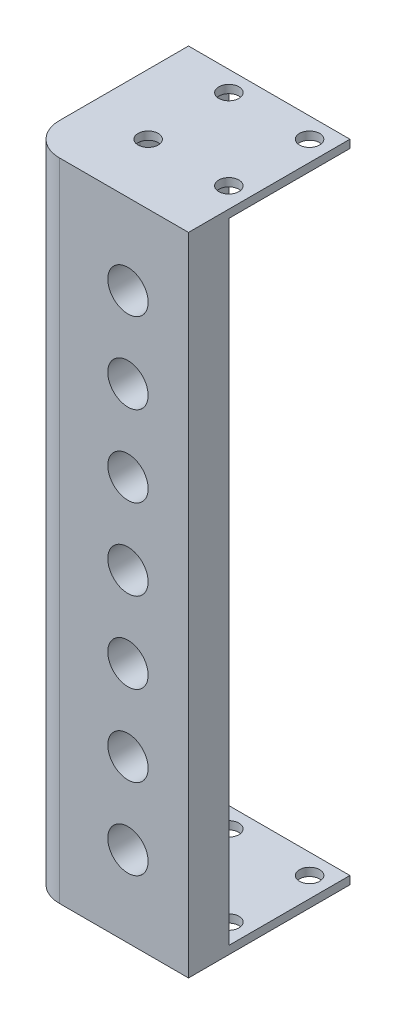
ISO-10303-21;
HEADER;
FILE_DESCRIPTION(('STEP AP214'),'2;1');
FILE_NAME('part.step','',(''),(''),'','','');
FILE_SCHEMA(('AUTOMOTIVE_DESIGN { 1 0 10303 214 1 1 1 1 }'));
ENDSEC;
DATA;
#1=APPLICATION_CONTEXT('core data for automotive mechanical design processes');
#2=APPLICATION_PROTOCOL_DEFINITION('international standard','automotive_design',2000,#1);
#3=PRODUCT_CONTEXT('',#1,'mechanical');
#4=PRODUCT('Part','Part','',(#3));
#5=PRODUCT_RELATED_PRODUCT_CATEGORY('part','',(#4));
#6=PRODUCT_DEFINITION_FORMATION('','',#4);
#7=PRODUCT_DEFINITION_CONTEXT('part definition',#1,'design');
#8=PRODUCT_DEFINITION('design','',#6,#7);
#9=PRODUCT_DEFINITION_SHAPE('','',#8);
#10=(LENGTH_UNIT() NAMED_UNIT(*) SI_UNIT(.MILLI.,.METRE.));
#11=(NAMED_UNIT(*) PLANE_ANGLE_UNIT() SI_UNIT($,.RADIAN.));
#12=(NAMED_UNIT(*) SI_UNIT($,.STERADIAN.) SOLID_ANGLE_UNIT());
#13=UNCERTAINTY_MEASURE_WITH_UNIT(LENGTH_MEASURE(1.E-05),#10,'distance_accuracy_value','');
#14=(GEOMETRIC_REPRESENTATION_CONTEXT(3) GLOBAL_UNCERTAINTY_ASSIGNED_CONTEXT((#13)) GLOBAL_UNIT_ASSIGNED_CONTEXT((#10,
#11,#12)) REPRESENTATION_CONTEXT('',''));
#15=CARTESIAN_POINT('',(0.,0.,0.));
#16=DIRECTION('',(0.,0.,1.));
#17=DIRECTION('',(1.,0.,0.));
#18=AXIS2_PLACEMENT_3D('',#15,#16,#17);
#19=CARTESIAN_POINT('',(50.8,203.2,-12.7));
#20=DIRECTION('',(0.,0.,1.));
#21=DIRECTION('',(1.,0.,0.));
#22=AXIS2_PLACEMENT_3D('',#19,#20,#21);
#23=PLANE('',#22);
#24=CARTESIAN_POINT('',(31.75,177.8,-12.7));
#25=DIRECTION('',(0.,0.,1.));
#26=DIRECTION('',(1.,0.,0.));
#27=AXIS2_PLACEMENT_3D('',#24,#25,#26);
#28=CIRCLE('',#27,6.35);
#29=CARTESIAN_POINT('',(38.1,177.8,-12.7));
#30=VERTEX_POINT('',#29);
#31=EDGE_CURVE('E261',#30,#30,#28,.T.);
#32=ORIENTED_EDGE('',*,*,#31,.T.);
#33=EDGE_LOOP('',(#32));
#34=FACE_BOUND('',#33,.T.);
#35=CARTESIAN_POINT('',(31.75,152.4,-12.7));
#36=DIRECTION('',(0.,0.,1.));
#37=DIRECTION('',(1.,0.,0.));
#38=AXIS2_PLACEMENT_3D('',#35,#36,#37);
#39=CIRCLE('',#38,6.35);
#40=CARTESIAN_POINT('',(38.1,152.4,-12.7));
#41=VERTEX_POINT('',#40);
#42=EDGE_CURVE('E296',#41,#41,#39,.T.);
#43=ORIENTED_EDGE('',*,*,#42,.T.);
#44=EDGE_LOOP('',(#43));
#45=FACE_BOUND('',#44,.T.);
#46=CARTESIAN_POINT('',(31.75,127.,-12.7));
#47=DIRECTION('',(0.,0.,1.));
#48=DIRECTION('',(1.,0.,0.));
#49=AXIS2_PLACEMENT_3D('',#46,#47,#48);
#50=CIRCLE('',#49,6.35);
#51=CARTESIAN_POINT('',(38.1,127.,-12.7));
#52=VERTEX_POINT('',#51);
#53=EDGE_CURVE('E293',#52,#52,#50,.T.);
#54=ORIENTED_EDGE('',*,*,#53,.T.);
#55=EDGE_LOOP('',(#54));
#56=FACE_BOUND('',#55,.T.);
#57=CARTESIAN_POINT('',(31.75,101.6,-12.7));
#58=DIRECTION('',(0.,0.,1.));
#59=DIRECTION('',(1.,0.,0.));
#60=AXIS2_PLACEMENT_3D('',#57,#58,#59);
#61=CIRCLE('',#60,6.35);
#62=CARTESIAN_POINT('',(38.1,101.6,-12.7));
#63=VERTEX_POINT('',#62);
#64=EDGE_CURVE('E290',#63,#63,#61,.T.);
#65=ORIENTED_EDGE('',*,*,#64,.T.);
#66=EDGE_LOOP('',(#65));
#67=FACE_BOUND('',#66,.T.);
#68=CARTESIAN_POINT('',(31.75,76.2,-12.7));
#69=DIRECTION('',(0.,0.,1.));
#70=DIRECTION('',(1.,0.,0.));
#71=AXIS2_PLACEMENT_3D('',#68,#69,#70);
#72=CIRCLE('',#71,6.35);
#73=CARTESIAN_POINT('',(38.1,76.2,-12.7));
#74=VERTEX_POINT('',#73);
#75=EDGE_CURVE('E287',#74,#74,#72,.T.);
#76=ORIENTED_EDGE('',*,*,#75,.T.);
#77=EDGE_LOOP('',(#76));
#78=FACE_BOUND('',#77,.T.);
#79=CARTESIAN_POINT('',(31.75,50.8,-12.7));
#80=DIRECTION('',(0.,0.,1.));
#81=DIRECTION('',(1.,0.,0.));
#82=AXIS2_PLACEMENT_3D('',#79,#80,#81);
#83=CIRCLE('',#82,6.35);
#84=CARTESIAN_POINT('',(38.1,50.8,-12.7));
#85=VERTEX_POINT('',#84);
#86=EDGE_CURVE('E284',#85,#85,#83,.T.);
#87=ORIENTED_EDGE('',*,*,#86,.T.);
#88=EDGE_LOOP('',(#87));
#89=FACE_BOUND('',#88,.T.);
#90=CARTESIAN_POINT('',(31.75,25.4,-12.7));
#91=DIRECTION('',(0.,0.,1.));
#92=DIRECTION('',(1.,0.,0.));
#93=AXIS2_PLACEMENT_3D('',#90,#91,#92);
#94=CIRCLE('',#93,6.35);
#95=CARTESIAN_POINT('',(38.1,25.4,-12.7));
#96=VERTEX_POINT('',#95);
#97=EDGE_CURVE('E227',#96,#96,#94,.T.);
#98=ORIENTED_EDGE('',*,*,#97,.T.);
#99=EDGE_LOOP('',(#98));
#100=FACE_BOUND('',#99,.T.);
#101=DIRECTION('',(-1.,0.,0.));
#102=VECTOR('',#101,1.);
#103=CARTESIAN_POINT('',(0.,2.54,-12.7));
#104=LINE('',#103,#102);
#105=CARTESIAN_POINT('',(50.8,2.53999999999999,-12.7));
#106=VERTEX_POINT('',#105);
#107=CARTESIAN_POINT('',(22.86,2.53999999999999,-12.7));
#108=VERTEX_POINT('',#107);
#109=EDGE_CURVE('E67',#106,#108,#104,.T.);
#110=ORIENTED_EDGE('',*,*,#109,.T.);
#111=DIRECTION('',(0.,-1.,0.));
#112=VECTOR('',#111,1.);
#113=CARTESIAN_POINT('',(22.86,203.2,-12.7));
#114=LINE('',#113,#112);
#115=CARTESIAN_POINT('',(22.86,200.66,-12.7));
#116=VERTEX_POINT('',#115);
#117=EDGE_CURVE('E11',#108,#116,#114,.F.);
#118=ORIENTED_EDGE('',*,*,#117,.T.);
#119=DIRECTION('',(-1.,0.,0.));
#120=VECTOR('',#119,1.);
#121=CARTESIAN_POINT('',(0.,200.66,-12.7));
#122=LINE('',#121,#120);
#123=CARTESIAN_POINT('',(50.8,200.66,-12.7));
#124=VERTEX_POINT('',#123);
#125=EDGE_CURVE('E186',#124,#116,#122,.T.);
#126=ORIENTED_EDGE('',*,*,#125,.F.);
#127=DIRECTION('',(0.,-1.,0.));
#128=VECTOR('',#127,1.);
#129=CARTESIAN_POINT('',(50.8,203.2,-12.7));
#130=LINE('',#129,#128);
#131=EDGE_CURVE('E268',#124,#106,#130,.T.);
#132=ORIENTED_EDGE('',*,*,#131,.T.);
#133=EDGE_LOOP('',(#110,#118,#126,#132));
#134=FACE_BOUND('',#133,.T.);
#135=ADVANCED_FACE('F43',(#34,#45,#56,#67,#78,#89,#100,#134),#23,.F.);
#136=CARTESIAN_POINT('',(12.7,203.2,-50.8));
#137=DIRECTION('',(-1.,0.,0.));
#138=DIRECTION('',(0.,0.,1.));
#139=AXIS2_PLACEMENT_3D('',#136,#137,#138);
#140=PLANE('',#139);
#141=CARTESIAN_POINT('',(12.7,177.8,-31.75));
#142=DIRECTION('',(-1.,0.,0.));
#143=DIRECTION('',(0.,0.,1.));
#144=AXIS2_PLACEMENT_3D('',#141,#142,#143);
#145=CIRCLE('',#144,6.35);
#146=CARTESIAN_POINT('',(12.7,177.8,-25.4));
#147=VERTEX_POINT('',#146);
#148=EDGE_CURVE('E47',#147,#147,#145,.T.);
#149=ORIENTED_EDGE('',*,*,#148,.T.);
#150=EDGE_LOOP('',(#149));
#151=FACE_BOUND('',#150,.T.);
#152=CARTESIAN_POINT('',(12.7,152.4,-31.75));
#153=DIRECTION('',(-1.,0.,0.));
#154=DIRECTION('',(0.,0.,1.));
#155=AXIS2_PLACEMENT_3D('',#152,#153,#154);
#156=CIRCLE('',#155,6.35);
#157=CARTESIAN_POINT('',(12.7,152.4,-25.4));
#158=VERTEX_POINT('',#157);
#159=EDGE_CURVE('E314',#158,#158,#156,.T.);
#160=ORIENTED_EDGE('',*,*,#159,.T.);
#161=EDGE_LOOP('',(#160));
#162=FACE_BOUND('',#161,.T.);
#163=CARTESIAN_POINT('',(12.7,127.,-31.75));
#164=DIRECTION('',(-1.,0.,0.));
#165=DIRECTION('',(0.,0.,1.));
#166=AXIS2_PLACEMENT_3D('',#163,#164,#165);
#167=CIRCLE('',#166,6.35);
#168=CARTESIAN_POINT('',(12.7,127.,-25.4));
#169=VERTEX_POINT('',#168);
#170=EDGE_CURVE('E312',#169,#169,#167,.T.);
#171=ORIENTED_EDGE('',*,*,#170,.T.);
#172=EDGE_LOOP('',(#171));
#173=FACE_BOUND('',#172,.T.);
#174=CARTESIAN_POINT('',(12.7,101.6,-31.75));
#175=DIRECTION('',(-1.,0.,0.));
#176=DIRECTION('',(0.,0.,1.));
#177=AXIS2_PLACEMENT_3D('',#174,#175,#176);
#178=CIRCLE('',#177,6.35);
#179=CARTESIAN_POINT('',(12.7,101.6,-25.4));
#180=VERTEX_POINT('',#179);
#181=EDGE_CURVE('E309',#180,#180,#178,.T.);
#182=ORIENTED_EDGE('',*,*,#181,.T.);
#183=EDGE_LOOP('',(#182));
#184=FACE_BOUND('',#183,.T.);
#185=CARTESIAN_POINT('',(12.7,76.2,-31.75));
#186=DIRECTION('',(-1.,0.,0.));
#187=DIRECTION('',(0.,0.,1.));
#188=AXIS2_PLACEMENT_3D('',#185,#186,#187);
#189=CIRCLE('',#188,6.35);
#190=CARTESIAN_POINT('',(12.7,76.2,-25.4));
#191=VERTEX_POINT('',#190);
#192=EDGE_CURVE('E306',#191,#191,#189,.T.);
#193=ORIENTED_EDGE('',*,*,#192,.T.);
#194=EDGE_LOOP('',(#193));
#195=FACE_BOUND('',#194,.T.);
#196=CARTESIAN_POINT('',(12.7,50.8,-31.75));
#197=DIRECTION('',(-1.,0.,0.));
#198=DIRECTION('',(0.,0.,1.));
#199=AXIS2_PLACEMENT_3D('',#196,#197,#198);
#200=CIRCLE('',#199,6.35);
#201=CARTESIAN_POINT('',(12.7,50.8,-25.4));
#202=VERTEX_POINT('',#201);
#203=EDGE_CURVE('E303',#202,#202,#200,.T.);
#204=ORIENTED_EDGE('',*,*,#203,.T.);
#205=EDGE_LOOP('',(#204));
#206=FACE_BOUND('',#205,.T.);
#207=CARTESIAN_POINT('',(12.7,25.4,-31.75));
#208=DIRECTION('',(-1.,0.,0.));
#209=DIRECTION('',(0.,0.,1.));
#210=AXIS2_PLACEMENT_3D('',#207,#208,#209);
#211=CIRCLE('',#210,6.35);
#212=CARTESIAN_POINT('',(12.7,25.4,-25.4));
#213=VERTEX_POINT('',#212);
#214=EDGE_CURVE('E206',#213,#213,#211,.T.);
#215=ORIENTED_EDGE('',*,*,#214,.T.);
#216=EDGE_LOOP('',(#215));
#217=FACE_BOUND('',#216,.T.);
#218=DIRECTION('',(0.,0.,-1.));
#219=VECTOR('',#218,1.);
#220=CARTESIAN_POINT('',(12.7,2.54,0.));
#221=LINE('',#220,#219);
#222=CARTESIAN_POINT('',(12.7,2.53999999999999,-22.86));
#223=VERTEX_POINT('',#222);
#224=CARTESIAN_POINT('',(12.7,2.53999999999999,-50.8));
#225=VERTEX_POINT('',#224);
#226=EDGE_CURVE('E147',#223,#225,#221,.T.);
#227=ORIENTED_EDGE('',*,*,#226,.T.);
#228=DIRECTION('',(0.,-1.,0.));
#229=VECTOR('',#228,1.);
#230=CARTESIAN_POINT('',(12.7,203.2,-50.8));
#231=LINE('',#230,#229);
#232=CARTESIAN_POINT('',(12.7,200.66,-50.8));
#233=VERTEX_POINT('',#232);
#234=EDGE_CURVE('E146',#233,#225,#231,.T.);
#235=ORIENTED_EDGE('',*,*,#234,.F.);
#236=DIRECTION('',(0.,0.,-1.));
#237=VECTOR('',#236,1.);
#238=CARTESIAN_POINT('',(12.7,200.66,0.));
#239=LINE('',#238,#237);
#240=CARTESIAN_POINT('',(12.7,200.66,-22.86));
#241=VERTEX_POINT('',#240);
#242=EDGE_CURVE('E182',#241,#233,#239,.T.);
#243=ORIENTED_EDGE('',*,*,#242,.F.);
#244=DIRECTION('',(0.,-1.,0.));
#245=VECTOR('',#244,1.);
#246=CARTESIAN_POINT('',(12.7,0.,-22.86));
#247=LINE('',#246,#245);
#248=EDGE_CURVE('E52',#241,#223,#247,.T.);
#249=ORIENTED_EDGE('',*,*,#248,.T.);
#250=EDGE_LOOP('',(#227,#235,#243,#249));
#251=FACE_BOUND('',#250,.T.);
#252=ADVANCED_FACE('F321',(#151,#162,#173,#184,#195,#206,#217,#251),#140,.F.);
#253=CARTESIAN_POINT('',(22.86,203.2,-22.86));
#254=DIRECTION('',(0.,1.,0.));
#255=DIRECTION('',(0.,0.,1.));
#256=AXIS2_PLACEMENT_3D('',#253,#254,#255);
#257=CYLINDRICAL_SURFACE('',#256,10.16);
#258=CARTESIAN_POINT('',(22.86,2.54,-22.86));
#259=DIRECTION('',(0.,1.,0.));
#260=DIRECTION('',(0.,0.,1.));
#261=AXIS2_PLACEMENT_3D('',#258,#259,#260);
#262=CIRCLE('',#261,10.16);
#263=EDGE_CURVE('E60',#108,#223,#262,.F.);
#264=ORIENTED_EDGE('',*,*,#263,.T.);
#265=ORIENTED_EDGE('',*,*,#248,.F.);
#266=CARTESIAN_POINT('',(22.86,200.66,-22.86));
#267=DIRECTION('',(0.,1.,0.));
#268=DIRECTION('',(0.,0.,1.));
#269=AXIS2_PLACEMENT_3D('',#266,#267,#268);
#270=CIRCLE('',#269,10.16);
#271=EDGE_CURVE('E184',#116,#241,#270,.F.);
#272=ORIENTED_EDGE('',*,*,#271,.F.);
#273=ORIENTED_EDGE('',*,*,#117,.F.);
#274=EDGE_LOOP('',(#264,#265,#272,#273));
#275=FACE_BOUND('',#274,.T.);
#276=ADVANCED_FACE('F45',(#275),#257,.F.);
#277=CARTESIAN_POINT('',(0.,203.2,0.));
#278=DIRECTION('',(1.,0.,0.));
#279=DIRECTION('',(0.,0.,-1.));
#280=AXIS2_PLACEMENT_3D('',#277,#278,#279);
#281=PLANE('',#280);
#282=CARTESIAN_POINT('',(0.,177.8,-31.75));
#283=DIRECTION('',(-1.,0.,0.));
#284=DIRECTION('',(0.,0.,1.));
#285=AXIS2_PLACEMENT_3D('',#282,#283,#284);
#286=CIRCLE('',#285,6.35);
#287=CARTESIAN_POINT('',(0.,177.8,-25.4));
#288=VERTEX_POINT('',#287);
#289=EDGE_CURVE('E203',#288,#288,#286,.T.);
#290=ORIENTED_EDGE('',*,*,#289,.F.);
#291=EDGE_LOOP('',(#290));
#292=FACE_BOUND('',#291,.T.);
#293=CARTESIAN_POINT('',(0.,152.4,-31.75));
#294=DIRECTION('',(-1.,0.,0.));
#295=DIRECTION('',(0.,0.,1.));
#296=AXIS2_PLACEMENT_3D('',#293,#294,#295);
#297=CIRCLE('',#296,6.35);
#298=CARTESIAN_POINT('',(0.,152.4,-25.4));
#299=VERTEX_POINT('',#298);
#300=EDGE_CURVE('E207',#299,#299,#297,.T.);
#301=ORIENTED_EDGE('',*,*,#300,.F.);
#302=EDGE_LOOP('',(#301));
#303=FACE_BOUND('',#302,.T.);
#304=CARTESIAN_POINT('',(0.,127.,-31.75));
#305=DIRECTION('',(-1.,0.,0.));
#306=DIRECTION('',(0.,0.,1.));
#307=AXIS2_PLACEMENT_3D('',#304,#305,#306);
#308=CIRCLE('',#307,6.35);
#309=CARTESIAN_POINT('',(0.,127.,-25.4));
#310=VERTEX_POINT('',#309);
#311=EDGE_CURVE('E210',#310,#310,#308,.T.);
#312=ORIENTED_EDGE('',*,*,#311,.F.);
#313=EDGE_LOOP('',(#312));
#314=FACE_BOUND('',#313,.T.);
#315=CARTESIAN_POINT('',(0.,101.6,-31.75));
#316=DIRECTION('',(-1.,0.,0.));
#317=DIRECTION('',(0.,0.,1.));
#318=AXIS2_PLACEMENT_3D('',#315,#316,#317);
#319=CIRCLE('',#318,6.35);
#320=CARTESIAN_POINT('',(0.,101.6,-25.4));
#321=VERTEX_POINT('',#320);
#322=EDGE_CURVE('E213',#321,#321,#319,.T.);
#323=ORIENTED_EDGE('',*,*,#322,.F.);
#324=EDGE_LOOP('',(#323));
#325=FACE_BOUND('',#324,.T.);
#326=CARTESIAN_POINT('',(0.,76.2,-31.75));
#327=DIRECTION('',(-1.,0.,0.));
#328=DIRECTION('',(0.,0.,1.));
#329=AXIS2_PLACEMENT_3D('',#326,#327,#328);
#330=CIRCLE('',#329,6.35);
#331=CARTESIAN_POINT('',(0.,76.2,-25.4));
#332=VERTEX_POINT('',#331);
#333=EDGE_CURVE('E216',#332,#332,#330,.T.);
#334=ORIENTED_EDGE('',*,*,#333,.F.);
#335=EDGE_LOOP('',(#334));
#336=FACE_BOUND('',#335,.T.);
#337=CARTESIAN_POINT('',(0.,50.8,-31.75));
#338=DIRECTION('',(-1.,0.,0.));
#339=DIRECTION('',(0.,0.,1.));
#340=AXIS2_PLACEMENT_3D('',#337,#338,#339);
#341=CIRCLE('',#340,6.35);
#342=CARTESIAN_POINT('',(0.,50.8,-25.4));
#343=VERTEX_POINT('',#342);
#344=EDGE_CURVE('E219',#343,#343,#341,.T.);
#345=ORIENTED_EDGE('',*,*,#344,.F.);
#346=EDGE_LOOP('',(#345));
#347=FACE_BOUND('',#346,.T.);
#348=CARTESIAN_POINT('',(0.,25.4,-31.75));
#349=DIRECTION('',(-1.,0.,0.));
#350=DIRECTION('',(0.,0.,1.));
#351=AXIS2_PLACEMENT_3D('',#348,#349,#350);
#352=CIRCLE('',#351,6.35);
#353=CARTESIAN_POINT('',(0.,25.4,-25.4));
#354=VERTEX_POINT('',#353);
#355=EDGE_CURVE('E202',#354,#354,#352,.T.);
#356=ORIENTED_EDGE('',*,*,#355,.F.);
#357=EDGE_LOOP('',(#356));
#358=FACE_BOUND('',#357,.T.);
#359=DIRECTION('',(0.,0.,1.));
#360=VECTOR('',#359,1.);
#361=CARTESIAN_POINT('',(0.,0.,0.));
#362=LINE('',#361,#360);
#363=CARTESIAN_POINT('',(0.,0.,-50.8));
#364=VERTEX_POINT('',#363);
#365=CARTESIAN_POINT('',(0.,0.,-10.16));
#366=VERTEX_POINT('',#365);
#367=EDGE_CURVE('E257',#364,#366,#362,.T.);
#368=ORIENTED_EDGE('',*,*,#367,.T.);
#369=DIRECTION('',(0.,-1.,0.));
#370=VECTOR('',#369,1.);
#371=CARTESIAN_POINT('',(0.,203.2,-10.16));
#372=LINE('',#371,#370);
#373=CARTESIAN_POINT('',(0.,203.2,-10.16));
#374=VERTEX_POINT('',#373);
#375=EDGE_CURVE('E277',#366,#374,#372,.F.);
#376=ORIENTED_EDGE('',*,*,#375,.T.);
#377=DIRECTION('',(0.,0.,1.));
#378=VECTOR('',#377,1.);
#379=CARTESIAN_POINT('',(0.,203.2,0.));
#380=LINE('',#379,#378);
#381=CARTESIAN_POINT('',(0.,203.2,-50.8));
#382=VERTEX_POINT('',#381);
#383=EDGE_CURVE('E246',#382,#374,#380,.T.);
#384=ORIENTED_EDGE('',*,*,#383,.F.);
#385=DIRECTION('',(0.,-1.,0.));
#386=VECTOR('',#385,1.);
#387=CARTESIAN_POINT('',(0.,203.2,-50.8));
#388=LINE('',#387,#386);
#389=EDGE_CURVE('E256',#382,#364,#388,.T.);
#390=ORIENTED_EDGE('',*,*,#389,.T.);
#391=EDGE_LOOP('',(#368,#376,#384,#390));
#392=FACE_BOUND('',#391,.T.);
#393=ADVANCED_FACE('F357',(#292,#303,#314,#325,#336,#347,#358,#392),#281,.F.);
#394=CARTESIAN_POINT('',(0.,203.2,0.));
#395=DIRECTION('',(0.,0.,-1.));
#396=DIRECTION('',(-1.,0.,0.));
#397=AXIS2_PLACEMENT_3D('',#394,#395,#396);
#398=PLANE('',#397);
#399=CARTESIAN_POINT('',(31.75,177.8,0.));
#400=DIRECTION('',(0.,0.,1.));
#401=DIRECTION('',(1.,0.,0.));
#402=AXIS2_PLACEMENT_3D('',#399,#400,#401);
#403=CIRCLE('',#402,6.35);
#404=CARTESIAN_POINT('',(38.1,177.8,0.));
#405=VERTEX_POINT('',#404);
#406=EDGE_CURVE('E224',#405,#405,#403,.T.);
#407=ORIENTED_EDGE('',*,*,#406,.F.);
#408=EDGE_LOOP('',(#407));
#409=FACE_BOUND('',#408,.T.);
#410=CARTESIAN_POINT('',(31.75,152.4,0.));
#411=DIRECTION('',(0.,0.,1.));
#412=DIRECTION('',(1.,0.,0.));
#413=AXIS2_PLACEMENT_3D('',#410,#411,#412);
#414=CIRCLE('',#413,6.35);
#415=CARTESIAN_POINT('',(38.1,152.4,0.));
#416=VERTEX_POINT('',#415);
#417=EDGE_CURVE('E228',#416,#416,#414,.T.);
#418=ORIENTED_EDGE('',*,*,#417,.F.);
#419=EDGE_LOOP('',(#418));
#420=FACE_BOUND('',#419,.T.);
#421=CARTESIAN_POINT('',(31.75,127.,0.));
#422=DIRECTION('',(0.,0.,1.));
#423=DIRECTION('',(1.,0.,0.));
#424=AXIS2_PLACEMENT_3D('',#421,#422,#423);
#425=CIRCLE('',#424,6.35);
#426=CARTESIAN_POINT('',(38.1,127.,0.));
#427=VERTEX_POINT('',#426);
#428=EDGE_CURVE('E231',#427,#427,#425,.T.);
#429=ORIENTED_EDGE('',*,*,#428,.F.);
#430=EDGE_LOOP('',(#429));
#431=FACE_BOUND('',#430,.T.);
#432=CARTESIAN_POINT('',(31.75,101.6,0.));
#433=DIRECTION('',(0.,0.,1.));
#434=DIRECTION('',(1.,0.,0.));
#435=AXIS2_PLACEMENT_3D('',#432,#433,#434);
#436=CIRCLE('',#435,6.35);
#437=CARTESIAN_POINT('',(38.1,101.6,0.));
#438=VERTEX_POINT('',#437);
#439=EDGE_CURVE('E234',#438,#438,#436,.T.);
#440=ORIENTED_EDGE('',*,*,#439,.F.);
#441=EDGE_LOOP('',(#440));
#442=FACE_BOUND('',#441,.T.);
#443=CARTESIAN_POINT('',(31.75,76.2,0.));
#444=DIRECTION('',(0.,0.,1.));
#445=DIRECTION('',(1.,0.,0.));
#446=AXIS2_PLACEMENT_3D('',#443,#444,#445);
#447=CIRCLE('',#446,6.35);
#448=CARTESIAN_POINT('',(38.1,76.2,0.));
#449=VERTEX_POINT('',#448);
#450=EDGE_CURVE('E237',#449,#449,#447,.T.);
#451=ORIENTED_EDGE('',*,*,#450,.F.);
#452=EDGE_LOOP('',(#451));
#453=FACE_BOUND('',#452,.T.);
#454=CARTESIAN_POINT('',(31.75,50.8,0.));
#455=DIRECTION('',(0.,0.,1.));
#456=DIRECTION('',(1.,0.,0.));
#457=AXIS2_PLACEMENT_3D('',#454,#455,#456);
#458=CIRCLE('',#457,6.35);
#459=CARTESIAN_POINT('',(38.1,50.8,0.));
#460=VERTEX_POINT('',#459);
#461=EDGE_CURVE('E240',#460,#460,#458,.T.);
#462=ORIENTED_EDGE('',*,*,#461,.F.);
#463=EDGE_LOOP('',(#462));
#464=FACE_BOUND('',#463,.T.);
#465=CARTESIAN_POINT('',(31.75,25.4,0.));
#466=DIRECTION('',(0.,0.,1.));
#467=DIRECTION('',(1.,0.,0.));
#468=AXIS2_PLACEMENT_3D('',#465,#466,#467);
#469=CIRCLE('',#468,6.35);
#470=CARTESIAN_POINT('',(38.1,25.4,0.));
#471=VERTEX_POINT('',#470);
#472=EDGE_CURVE('E243',#471,#471,#469,.T.);
#473=ORIENTED_EDGE('',*,*,#472,.F.);
#474=EDGE_LOOP('',(#473));
#475=FACE_BOUND('',#474,.T.);
#476=DIRECTION('',(1.,0.,0.));
#477=VECTOR('',#476,1.);
#478=CARTESIAN_POINT('',(0.,203.2,0.));
#479=LINE('',#478,#477);
#480=CARTESIAN_POINT('',(10.16,203.2,0.));
#481=VERTEX_POINT('',#480);
#482=CARTESIAN_POINT('',(50.8,203.2,0.));
#483=VERTEX_POINT('',#482);
#484=EDGE_CURVE('E249',#481,#483,#479,.T.);
#485=ORIENTED_EDGE('',*,*,#484,.F.);
#486=DIRECTION('',(0.,-1.,0.));
#487=VECTOR('',#486,1.);
#488=CARTESIAN_POINT('',(10.16,203.2,0.));
#489=LINE('',#488,#487);
#490=CARTESIAN_POINT('',(10.16,0.,0.));
#491=VERTEX_POINT('',#490);
#492=EDGE_CURVE('E272',#481,#491,#489,.T.);
#493=ORIENTED_EDGE('',*,*,#492,.T.);
#494=DIRECTION('',(1.,0.,0.));
#495=VECTOR('',#494,1.);
#496=CARTESIAN_POINT('',(0.,0.,0.));
#497=LINE('',#496,#495);
#498=CARTESIAN_POINT('',(50.8,0.,0.));
#499=VERTEX_POINT('',#498);
#500=EDGE_CURVE('E260',#491,#499,#497,.T.);
#501=ORIENTED_EDGE('',*,*,#500,.T.);
#502=DIRECTION('',(0.,-1.,0.));
#503=VECTOR('',#502,1.);
#504=CARTESIAN_POINT('',(50.8,203.2,0.));
#505=LINE('',#504,#503);
#506=EDGE_CURVE('E270',#483,#499,#505,.T.);
#507=ORIENTED_EDGE('',*,*,#506,.F.);
#508=EDGE_LOOP('',(#485,#493,#501,#507));
#509=FACE_BOUND('',#508,.T.);
#510=ADVANCED_FACE('F354',(#409,#420,#431,#442,#453,#464,#475,#509),#398,.F.);
#511=CARTESIAN_POINT('',(50.8,203.2,0.));
#512=DIRECTION('',(-1.,0.,0.));
#513=DIRECTION('',(0.,0.,1.));
#514=AXIS2_PLACEMENT_3D('',#511,#512,#513);
#515=PLANE('',#514);
#516=DIRECTION('',(0.,0.,-1.));
#517=VECTOR('',#516,1.);
#518=CARTESIAN_POINT('',(50.8,0.,0.));
#519=LINE('',#518,#517);
#520=CARTESIAN_POINT('',(50.8,0.,-50.8));
#521=VERTEX_POINT('',#520);
#522=EDGE_CURVE('E130',#499,#521,#519,.T.);
#523=ORIENTED_EDGE('',*,*,#522,.T.);
#524=DIRECTION('',(0.,-1.,0.));
#525=VECTOR('',#524,1.);
#526=CARTESIAN_POINT('',(50.8,2.54,-50.8));
#527=LINE('',#526,#525);
#528=CARTESIAN_POINT('',(50.8,2.54,-50.8));
#529=VERTEX_POINT('',#528);
#530=EDGE_CURVE('E123',#529,#521,#527,.T.);
#531=ORIENTED_EDGE('',*,*,#530,.F.);
#532=DIRECTION('',(0.,0.,1.));
#533=VECTOR('',#532,1.);
#534=CARTESIAN_POINT('',(50.8,2.54,0.));
#535=LINE('',#534,#533);
#536=EDGE_CURVE('E127',#529,#106,#535,.T.);
#537=ORIENTED_EDGE('',*,*,#536,.T.);
#538=ORIENTED_EDGE('',*,*,#131,.F.);
#539=DIRECTION('',(0.,0.,1.));
#540=VECTOR('',#539,1.);
#541=CARTESIAN_POINT('',(50.8,200.66,0.));
#542=LINE('',#541,#540);
#543=CARTESIAN_POINT('',(50.8,200.66,-50.8));
#544=VERTEX_POINT('',#543);
#545=EDGE_CURVE('E178',#544,#124,#542,.T.);
#546=ORIENTED_EDGE('',*,*,#545,.F.);
#547=DIRECTION('',(0.,1.,0.));
#548=VECTOR('',#547,1.);
#549=CARTESIAN_POINT('',(50.8,200.66,-50.8));
#550=LINE('',#549,#548);
#551=CARTESIAN_POINT('',(50.8,203.2,-50.8));
#552=VERTEX_POINT('',#551);
#553=EDGE_CURVE('E189',#544,#552,#550,.T.);
#554=ORIENTED_EDGE('',*,*,#553,.T.);
#555=DIRECTION('',(0.,0.,-1.));
#556=VECTOR('',#555,1.);
#557=CARTESIAN_POINT('',(50.8,203.2,0.));
#558=LINE('',#557,#556);
#559=EDGE_CURVE('E252',#483,#552,#558,.T.);
#560=ORIENTED_EDGE('',*,*,#559,.F.);
#561=ORIENTED_EDGE('',*,*,#506,.T.);
#562=EDGE_LOOP('',(#523,#531,#537,#538,#546,#554,#560,#561));
#563=FACE_BOUND('',#562,.T.);
#564=ADVANCED_FACE('F125',(#563),#515,.F.);
#565=CARTESIAN_POINT('',(0.,203.2,-50.8));
#566=DIRECTION('',(0.,0.,1.));
#567=DIRECTION('',(1.,0.,0.));
#568=AXIS2_PLACEMENT_3D('',#565,#566,#567);
#569=PLANE('',#568);
#570=DIRECTION('',(-1.,0.,0.));
#571=VECTOR('',#570,1.);
#572=CARTESIAN_POINT('',(0.,0.,-50.8));
#573=LINE('',#572,#571);
#574=EDGE_CURVE('E250',#521,#364,#573,.T.);
#575=ORIENTED_EDGE('',*,*,#574,.T.);
#576=ORIENTED_EDGE('',*,*,#389,.F.);
#577=DIRECTION('',(-1.,0.,0.));
#578=VECTOR('',#577,1.);
#579=CARTESIAN_POINT('',(0.,203.2,-50.8));
#580=LINE('',#579,#578);
#581=EDGE_CURVE('E254',#552,#382,#580,.T.);
#582=ORIENTED_EDGE('',*,*,#581,.F.);
#583=ORIENTED_EDGE('',*,*,#553,.F.);
#584=DIRECTION('',(1.,0.,0.));
#585=VECTOR('',#584,1.);
#586=CARTESIAN_POINT('',(0.,200.66,-50.8));
#587=LINE('',#586,#585);
#588=EDGE_CURVE('E180',#233,#544,#587,.T.);
#589=ORIENTED_EDGE('',*,*,#588,.F.);
#590=ORIENTED_EDGE('',*,*,#234,.T.);
#591=DIRECTION('',(1.,0.,0.));
#592=VECTOR('',#591,1.);
#593=CARTESIAN_POINT('',(0.,2.54,-50.8));
#594=LINE('',#593,#592);
#595=EDGE_CURVE('E134',#225,#529,#594,.T.);
#596=ORIENTED_EDGE('',*,*,#595,.T.);
#597=ORIENTED_EDGE('',*,*,#530,.T.);
#598=EDGE_LOOP('',(#575,#576,#582,#583,#589,#590,#596,#597));
#599=FACE_BOUND('',#598,.T.);
#600=ADVANCED_FACE('F143',(#599),#569,.F.);
#601=CARTESIAN_POINT('',(0.,203.2,0.));
#602=DIRECTION('',(0.,-1.,0.));
#603=DIRECTION('',(0.,0.,-1.));
#604=AXIS2_PLACEMENT_3D('',#601,#602,#603);
#605=PLANE('',#604);
#606=ORIENTED_EDGE('',*,*,#559,.T.);
#607=ORIENTED_EDGE('',*,*,#581,.T.);
#608=ORIENTED_EDGE('',*,*,#383,.T.);
#609=CARTESIAN_POINT('',(10.16,203.2,-10.16));
#610=DIRECTION('',(0.,-1.,0.));
#611=DIRECTION('',(0.,0.,-1.));
#612=AXIS2_PLACEMENT_3D('',#609,#610,#611);
#613=CIRCLE('',#612,10.16);
#614=EDGE_CURVE('E279',#374,#481,#613,.F.);
#615=ORIENTED_EDGE('',*,*,#614,.T.);
#616=ORIENTED_EDGE('',*,*,#484,.T.);
#617=EDGE_LOOP('',(#606,#607,#608,#615,#616));
#618=FACE_BOUND('',#617,.T.);
#619=CARTESIAN_POINT('',(19.05,203.2,-19.05));
#620=DIRECTION('',(0.,1.,0.));
#621=DIRECTION('',(0.,0.,1.));
#622=AXIS2_PLACEMENT_3D('',#619,#620,#621);
#623=CIRCLE('',#622,3.175);
#624=CARTESIAN_POINT('',(19.05,203.2,-15.875));
#625=VERTEX_POINT('',#624);
#626=EDGE_CURVE('E133',#625,#625,#623,.T.);
#627=ORIENTED_EDGE('',*,*,#626,.F.);
#628=EDGE_LOOP('',(#627));
#629=FACE_BOUND('',#628,.T.);
#630=CARTESIAN_POINT('',(44.45,203.2,-19.05));
#631=DIRECTION('',(0.,1.,0.));
#632=DIRECTION('',(0.,0.,1.));
#633=AXIS2_PLACEMENT_3D('',#630,#631,#632);
#634=CIRCLE('',#633,3.175);
#635=CARTESIAN_POINT('',(44.45,203.2,-15.875));
#636=VERTEX_POINT('',#635);
#637=EDGE_CURVE('E192',#636,#636,#634,.T.);
#638=ORIENTED_EDGE('',*,*,#637,.F.);
#639=EDGE_LOOP('',(#638));
#640=FACE_BOUND('',#639,.T.);
#641=CARTESIAN_POINT('',(44.45,203.2,-44.45));
#642=DIRECTION('',(0.,1.,0.));
#643=DIRECTION('',(0.,0.,1.));
#644=AXIS2_PLACEMENT_3D('',#641,#642,#643);
#645=CIRCLE('',#644,3.175);
#646=CARTESIAN_POINT('',(44.45,203.2,-41.275));
#647=VERTEX_POINT('',#646);
#648=EDGE_CURVE('E195',#647,#647,#645,.T.);
#649=ORIENTED_EDGE('',*,*,#648,.F.);
#650=EDGE_LOOP('',(#649));
#651=FACE_BOUND('',#650,.T.);
#652=CARTESIAN_POINT('',(19.05,203.2,-44.45));
#653=DIRECTION('',(0.,1.,0.));
#654=DIRECTION('',(0.,0.,1.));
#655=AXIS2_PLACEMENT_3D('',#652,#653,#654);
#656=CIRCLE('',#655,3.175);
#657=CARTESIAN_POINT('',(19.05,203.2,-41.275));
#658=VERTEX_POINT('',#657);
#659=EDGE_CURVE('E169',#658,#658,#656,.T.);
#660=ORIENTED_EDGE('',*,*,#659,.F.);
#661=EDGE_LOOP('',(#660));
#662=FACE_BOUND('',#661,.T.);
#663=ADVANCED_FACE('F373',(#618,#629,#640,#651,#662),#605,.F.);
#664=CARTESIAN_POINT('',(0.,0.,0.));
#665=DIRECTION('',(0.,-1.,0.));
#666=DIRECTION('',(0.,0.,-1.));
#667=AXIS2_PLACEMENT_3D('',#664,#665,#666);
#668=PLANE('',#667);
#669=ORIENTED_EDGE('',*,*,#574,.F.);
#670=ORIENTED_EDGE('',*,*,#522,.F.);
#671=ORIENTED_EDGE('',*,*,#500,.F.);
#672=CARTESIAN_POINT('',(10.16,0.,-10.16));
#673=DIRECTION('',(0.,-1.,0.));
#674=DIRECTION('',(0.,0.,-1.));
#675=AXIS2_PLACEMENT_3D('',#672,#673,#674);
#676=CIRCLE('',#675,10.16);
#677=EDGE_CURVE('E275',#491,#366,#676,.T.);
#678=ORIENTED_EDGE('',*,*,#677,.T.);
#679=ORIENTED_EDGE('',*,*,#367,.F.);
#680=EDGE_LOOP('',(#669,#670,#671,#678,#679));
#681=FACE_BOUND('',#680,.T.);
#682=CARTESIAN_POINT('',(19.05,0.,-19.05));
#683=DIRECTION('',(0.,1.,0.));
#684=DIRECTION('',(0.,0.,1.));
#685=AXIS2_PLACEMENT_3D('',#682,#683,#684);
#686=CIRCLE('',#685,3.175);
#687=CARTESIAN_POINT('',(19.05,0.,-15.875));
#688=VERTEX_POINT('',#687);
#689=EDGE_CURVE('E152',#688,#688,#686,.T.);
#690=ORIENTED_EDGE('',*,*,#689,.T.);
#691=EDGE_LOOP('',(#690));
#692=FACE_BOUND('',#691,.T.);
#693=CARTESIAN_POINT('',(44.45,0.,-19.05));
#694=DIRECTION('',(0.,1.,0.));
#695=DIRECTION('',(0.,0.,1.));
#696=AXIS2_PLACEMENT_3D('',#693,#694,#695);
#697=CIRCLE('',#696,3.175);
#698=CARTESIAN_POINT('',(44.45,0.,-15.875));
#699=VERTEX_POINT('',#698);
#700=EDGE_CURVE('E155',#699,#699,#697,.T.);
#701=ORIENTED_EDGE('',*,*,#700,.T.);
#702=EDGE_LOOP('',(#701));
#703=FACE_BOUND('',#702,.T.);
#704=CARTESIAN_POINT('',(44.45,0.,-44.45));
#705=DIRECTION('',(0.,1.,0.));
#706=DIRECTION('',(0.,0.,1.));
#707=AXIS2_PLACEMENT_3D('',#704,#705,#706);
#708=CIRCLE('',#707,3.175);
#709=CARTESIAN_POINT('',(44.45,0.,-41.275));
#710=VERTEX_POINT('',#709);
#711=EDGE_CURVE('E158',#710,#710,#708,.T.);
#712=ORIENTED_EDGE('',*,*,#711,.T.);
#713=EDGE_LOOP('',(#712));
#714=FACE_BOUND('',#713,.T.);
#715=CARTESIAN_POINT('',(19.05,0.,-44.45));
#716=DIRECTION('',(0.,1.,0.));
#717=DIRECTION('',(0.,0.,1.));
#718=AXIS2_PLACEMENT_3D('',#715,#716,#717);
#719=CIRCLE('',#718,3.175);
#720=CARTESIAN_POINT('',(19.05,0.,-41.275));
#721=VERTEX_POINT('',#720);
#722=EDGE_CURVE('E161',#721,#721,#719,.T.);
#723=ORIENTED_EDGE('',*,*,#722,.T.);
#724=EDGE_LOOP('',(#723));
#725=FACE_BOUND('',#724,.T.);
#726=ADVANCED_FACE('F364',(#681,#692,#703,#714,#725),#668,.T.);
#727=CARTESIAN_POINT('',(10.16,203.2,-10.16));
#728=DIRECTION('',(0.,-1.,0.));
#729=DIRECTION('',(0.,0.,-1.));
#730=AXIS2_PLACEMENT_3D('',#727,#728,#729);
#731=CYLINDRICAL_SURFACE('',#730,10.16);
#732=ORIENTED_EDGE('',*,*,#614,.F.);
#733=ORIENTED_EDGE('',*,*,#375,.F.);
#734=ORIENTED_EDGE('',*,*,#677,.F.);
#735=ORIENTED_EDGE('',*,*,#492,.F.);
#736=EDGE_LOOP('',(#732,#733,#734,#735));
#737=FACE_BOUND('',#736,.T.);
#738=ADVANCED_FACE('F361',(#737),#731,.T.);
#739=CARTESIAN_POINT('',(31.75,25.4,-50.8));
#740=DIRECTION('',(0.,0.,1.));
#741=DIRECTION('',(1.,0.,0.));
#742=AXIS2_PLACEMENT_3D('',#739,#740,#741);
#743=CYLINDRICAL_SURFACE('',#742,6.35);
#744=ORIENTED_EDGE('',*,*,#472,.T.);
#745=EDGE_LOOP('',(#744));
#746=FACE_BOUND('',#745,.T.);
#747=ORIENTED_EDGE('',*,*,#97,.F.);
#748=EDGE_LOOP('',(#747));
#749=FACE_BOUND('',#748,.T.);
#750=ADVANCED_FACE('F363',(#746,#749),#743,.F.);
#751=CARTESIAN_POINT('',(31.75,50.8,-50.8));
#752=DIRECTION('',(0.,0.,1.));
#753=DIRECTION('',(1.,0.,0.));
#754=AXIS2_PLACEMENT_3D('',#751,#752,#753);
#755=CYLINDRICAL_SURFACE('',#754,6.35);
#756=ORIENTED_EDGE('',*,*,#461,.T.);
#757=EDGE_LOOP('',(#756));
#758=FACE_BOUND('',#757,.T.);
#759=ORIENTED_EDGE('',*,*,#86,.F.);
#760=EDGE_LOOP('',(#759));
#761=FACE_BOUND('',#760,.T.);
#762=ADVANCED_FACE('F369',(#758,#761),#755,.F.);
#763=CARTESIAN_POINT('',(31.75,76.2,-50.8));
#764=DIRECTION('',(0.,0.,1.));
#765=DIRECTION('',(1.,0.,0.));
#766=AXIS2_PLACEMENT_3D('',#763,#764,#765);
#767=CYLINDRICAL_SURFACE('',#766,6.35);
#768=ORIENTED_EDGE('',*,*,#450,.T.);
#769=EDGE_LOOP('',(#768));
#770=FACE_BOUND('',#769,.T.);
#771=ORIENTED_EDGE('',*,*,#75,.F.);
#772=EDGE_LOOP('',(#771));
#773=FACE_BOUND('',#772,.T.);
#774=ADVANCED_FACE('F456',(#770,#773),#767,.F.);
#775=CARTESIAN_POINT('',(31.75,101.6,-50.8));
#776=DIRECTION('',(0.,0.,1.));
#777=DIRECTION('',(1.,0.,0.));
#778=AXIS2_PLACEMENT_3D('',#775,#776,#777);
#779=CYLINDRICAL_SURFACE('',#778,6.35);
#780=ORIENTED_EDGE('',*,*,#439,.T.);
#781=EDGE_LOOP('',(#780));
#782=FACE_BOUND('',#781,.T.);
#783=ORIENTED_EDGE('',*,*,#64,.F.);
#784=EDGE_LOOP('',(#783));
#785=FACE_BOUND('',#784,.T.);
#786=ADVANCED_FACE('F460',(#782,#785),#779,.F.);
#787=CARTESIAN_POINT('',(31.75,127.,-50.8));
#788=DIRECTION('',(0.,0.,1.));
#789=DIRECTION('',(1.,0.,0.));
#790=AXIS2_PLACEMENT_3D('',#787,#788,#789);
#791=CYLINDRICAL_SURFACE('',#790,6.35);
#792=ORIENTED_EDGE('',*,*,#428,.T.);
#793=EDGE_LOOP('',(#792));
#794=FACE_BOUND('',#793,.T.);
#795=ORIENTED_EDGE('',*,*,#53,.F.);
#796=EDGE_LOOP('',(#795));
#797=FACE_BOUND('',#796,.T.);
#798=ADVANCED_FACE('F464',(#794,#797),#791,.F.);
#799=CARTESIAN_POINT('',(31.75,152.4,-50.8));
#800=DIRECTION('',(0.,0.,1.));
#801=DIRECTION('',(1.,0.,0.));
#802=AXIS2_PLACEMENT_3D('',#799,#800,#801);
#803=CYLINDRICAL_SURFACE('',#802,6.35);
#804=ORIENTED_EDGE('',*,*,#417,.T.);
#805=EDGE_LOOP('',(#804));
#806=FACE_BOUND('',#805,.T.);
#807=ORIENTED_EDGE('',*,*,#42,.F.);
#808=EDGE_LOOP('',(#807));
#809=FACE_BOUND('',#808,.T.);
#810=ADVANCED_FACE('F468',(#806,#809),#803,.F.);
#811=CARTESIAN_POINT('',(31.75,177.8,-50.8));
#812=DIRECTION('',(0.,0.,1.));
#813=DIRECTION('',(1.,0.,0.));
#814=AXIS2_PLACEMENT_3D('',#811,#812,#813);
#815=CYLINDRICAL_SURFACE('',#814,6.35);
#816=ORIENTED_EDGE('',*,*,#406,.T.);
#817=EDGE_LOOP('',(#816));
#818=FACE_BOUND('',#817,.T.);
#819=ORIENTED_EDGE('',*,*,#31,.F.);
#820=EDGE_LOOP('',(#819));
#821=FACE_BOUND('',#820,.T.);
#822=ADVANCED_FACE('F472',(#818,#821),#815,.F.);
#823=CARTESIAN_POINT('',(50.8,25.4,-31.75));
#824=DIRECTION('',(-1.,0.,0.));
#825=DIRECTION('',(0.,0.,1.));
#826=AXIS2_PLACEMENT_3D('',#823,#824,#825);
#827=CYLINDRICAL_SURFACE('',#826,6.35);
#828=ORIENTED_EDGE('',*,*,#355,.T.);
#829=EDGE_LOOP('',(#828));
#830=FACE_BOUND('',#829,.T.);
#831=ORIENTED_EDGE('',*,*,#214,.F.);
#832=EDGE_LOOP('',(#831));
#833=FACE_BOUND('',#832,.T.);
#834=ADVANCED_FACE('F476',(#830,#833),#827,.F.);
#835=CARTESIAN_POINT('',(50.8,50.8,-31.75));
#836=DIRECTION('',(-1.,0.,0.));
#837=DIRECTION('',(0.,0.,1.));
#838=AXIS2_PLACEMENT_3D('',#835,#836,#837);
#839=CYLINDRICAL_SURFACE('',#838,6.35);
#840=ORIENTED_EDGE('',*,*,#344,.T.);
#841=EDGE_LOOP('',(#840));
#842=FACE_BOUND('',#841,.T.);
#843=ORIENTED_EDGE('',*,*,#203,.F.);
#844=EDGE_LOOP('',(#843));
#845=FACE_BOUND('',#844,.T.);
#846=ADVANCED_FACE('F480',(#842,#845),#839,.F.);
#847=CARTESIAN_POINT('',(50.8,76.2,-31.75));
#848=DIRECTION('',(-1.,0.,0.));
#849=DIRECTION('',(0.,0.,1.));
#850=AXIS2_PLACEMENT_3D('',#847,#848,#849);
#851=CYLINDRICAL_SURFACE('',#850,6.35);
#852=ORIENTED_EDGE('',*,*,#333,.T.);
#853=EDGE_LOOP('',(#852));
#854=FACE_BOUND('',#853,.T.);
#855=ORIENTED_EDGE('',*,*,#192,.F.);
#856=EDGE_LOOP('',(#855));
#857=FACE_BOUND('',#856,.T.);
#858=ADVANCED_FACE('F484',(#854,#857),#851,.F.);
#859=CARTESIAN_POINT('',(50.8,101.6,-31.75));
#860=DIRECTION('',(-1.,0.,0.));
#861=DIRECTION('',(0.,0.,1.));
#862=AXIS2_PLACEMENT_3D('',#859,#860,#861);
#863=CYLINDRICAL_SURFACE('',#862,6.35);
#864=ORIENTED_EDGE('',*,*,#322,.T.);
#865=EDGE_LOOP('',(#864));
#866=FACE_BOUND('',#865,.T.);
#867=ORIENTED_EDGE('',*,*,#181,.F.);
#868=EDGE_LOOP('',(#867));
#869=FACE_BOUND('',#868,.T.);
#870=ADVANCED_FACE('F488',(#866,#869),#863,.F.);
#871=CARTESIAN_POINT('',(50.8,127.,-31.75));
#872=DIRECTION('',(-1.,0.,0.));
#873=DIRECTION('',(0.,0.,1.));
#874=AXIS2_PLACEMENT_3D('',#871,#872,#873);
#875=CYLINDRICAL_SURFACE('',#874,6.35);
#876=ORIENTED_EDGE('',*,*,#311,.T.);
#877=EDGE_LOOP('',(#876));
#878=FACE_BOUND('',#877,.T.);
#879=ORIENTED_EDGE('',*,*,#170,.F.);
#880=EDGE_LOOP('',(#879));
#881=FACE_BOUND('',#880,.T.);
#882=ADVANCED_FACE('F337',(#878,#881),#875,.F.);
#883=CARTESIAN_POINT('',(50.8,152.4,-31.75));
#884=DIRECTION('',(-1.,0.,0.));
#885=DIRECTION('',(0.,0.,1.));
#886=AXIS2_PLACEMENT_3D('',#883,#884,#885);
#887=CYLINDRICAL_SURFACE('',#886,6.35);
#888=ORIENTED_EDGE('',*,*,#300,.T.);
#889=EDGE_LOOP('',(#888));
#890=FACE_BOUND('',#889,.T.);
#891=ORIENTED_EDGE('',*,*,#159,.F.);
#892=EDGE_LOOP('',(#891));
#893=FACE_BOUND('',#892,.T.);
#894=ADVANCED_FACE('F326',(#890,#893),#887,.F.);
#895=CARTESIAN_POINT('',(50.8,177.8,-31.75));
#896=DIRECTION('',(-1.,0.,0.));
#897=DIRECTION('',(0.,0.,1.));
#898=AXIS2_PLACEMENT_3D('',#895,#896,#897);
#899=CYLINDRICAL_SURFACE('',#898,6.35);
#900=ORIENTED_EDGE('',*,*,#289,.T.);
#901=EDGE_LOOP('',(#900));
#902=FACE_BOUND('',#901,.T.);
#903=ORIENTED_EDGE('',*,*,#148,.F.);
#904=EDGE_LOOP('',(#903));
#905=FACE_BOUND('',#904,.T.);
#906=ADVANCED_FACE('F323',(#902,#905),#899,.F.);
#907=CARTESIAN_POINT('',(19.05,200.66,-44.45));
#908=DIRECTION('',(0.,1.,0.));
#909=DIRECTION('',(0.,0.,1.));
#910=AXIS2_PLACEMENT_3D('',#907,#908,#909);
#911=CYLINDRICAL_SURFACE('',#910,3.175);
#912=CARTESIAN_POINT('',(19.05,200.66,-44.45));
#913=DIRECTION('',(0.,1.,0.));
#914=DIRECTION('',(0.,0.,1.));
#915=AXIS2_PLACEMENT_3D('',#912,#913,#914);
#916=CIRCLE('',#915,3.175);
#917=CARTESIAN_POINT('',(19.05,200.66,-41.275));
#918=VERTEX_POINT('',#917);
#919=EDGE_CURVE('E175',#918,#918,#916,.T.);
#920=ORIENTED_EDGE('',*,*,#919,.F.);
#921=EDGE_LOOP('',(#920));
#922=FACE_BOUND('',#921,.T.);
#923=ORIENTED_EDGE('',*,*,#659,.T.);
#924=EDGE_LOOP('',(#923));
#925=FACE_BOUND('',#924,.T.);
#926=ADVANCED_FACE('F325',(#922,#925),#911,.F.);
#927=CARTESIAN_POINT('',(44.45,200.66,-44.45));
#928=DIRECTION('',(0.,1.,0.));
#929=DIRECTION('',(0.,0.,1.));
#930=AXIS2_PLACEMENT_3D('',#927,#928,#929);
#931=CYLINDRICAL_SURFACE('',#930,3.175);
#932=CARTESIAN_POINT('',(44.45,200.66,-44.45));
#933=DIRECTION('',(0.,1.,0.));
#934=DIRECTION('',(0.,0.,1.));
#935=AXIS2_PLACEMENT_3D('',#932,#933,#934);
#936=CIRCLE('',#935,3.175);
#937=CARTESIAN_POINT('',(44.45,200.66,-41.275));
#938=VERTEX_POINT('',#937);
#939=EDGE_CURVE('E172',#938,#938,#936,.T.);
#940=ORIENTED_EDGE('',*,*,#939,.F.);
#941=EDGE_LOOP('',(#940));
#942=FACE_BOUND('',#941,.T.);
#943=ORIENTED_EDGE('',*,*,#648,.T.);
#944=EDGE_LOOP('',(#943));
#945=FACE_BOUND('',#944,.T.);
#946=ADVANCED_FACE('F334',(#942,#945),#931,.F.);
#947=CARTESIAN_POINT('',(44.45,200.66,-19.05));
#948=DIRECTION('',(0.,1.,0.));
#949=DIRECTION('',(0.,0.,1.));
#950=AXIS2_PLACEMENT_3D('',#947,#948,#949);
#951=CYLINDRICAL_SURFACE('',#950,3.175);
#952=CARTESIAN_POINT('',(44.45,200.66,-19.05));
#953=DIRECTION('',(0.,1.,0.));
#954=DIRECTION('',(0.,0.,1.));
#955=AXIS2_PLACEMENT_3D('',#952,#953,#954);
#956=CIRCLE('',#955,3.175);
#957=CARTESIAN_POINT('',(44.45,200.66,-15.875));
#958=VERTEX_POINT('',#957);
#959=EDGE_CURVE('E168',#958,#958,#956,.T.);
#960=ORIENTED_EDGE('',*,*,#959,.F.);
#961=EDGE_LOOP('',(#960));
#962=FACE_BOUND('',#961,.T.);
#963=ORIENTED_EDGE('',*,*,#637,.T.);
#964=EDGE_LOOP('',(#963));
#965=FACE_BOUND('',#964,.T.);
#966=ADVANCED_FACE('F429',(#962,#965),#951,.F.);
#967=CARTESIAN_POINT('',(19.05,200.66,-19.05));
#968=DIRECTION('',(0.,1.,0.));
#969=DIRECTION('',(0.,0.,1.));
#970=AXIS2_PLACEMENT_3D('',#967,#968,#969);
#971=CYLINDRICAL_SURFACE('',#970,3.175);
#972=CARTESIAN_POINT('',(19.05,200.66,-19.05));
#973=DIRECTION('',(0.,1.,0.));
#974=DIRECTION('',(0.,0.,1.));
#975=AXIS2_PLACEMENT_3D('',#972,#973,#974);
#976=CIRCLE('',#975,3.175);
#977=CARTESIAN_POINT('',(19.05,200.66,-15.875));
#978=VERTEX_POINT('',#977);
#979=EDGE_CURVE('E165',#978,#978,#976,.T.);
#980=ORIENTED_EDGE('',*,*,#979,.F.);
#981=EDGE_LOOP('',(#980));
#982=FACE_BOUND('',#981,.T.);
#983=ORIENTED_EDGE('',*,*,#626,.T.);
#984=EDGE_LOOP('',(#983));
#985=FACE_BOUND('',#984,.T.);
#986=ADVANCED_FACE('F414',(#982,#985),#971,.F.);
#987=CARTESIAN_POINT('',(0.,200.66,0.));
#988=DIRECTION('',(0.,1.,0.));
#989=DIRECTION('',(0.,0.,1.));
#990=AXIS2_PLACEMENT_3D('',#987,#988,#989);
#991=PLANE('',#990);
#992=ORIENTED_EDGE('',*,*,#979,.T.);
#993=EDGE_LOOP('',(#992));
#994=FACE_BOUND('',#993,.T.);
#995=ORIENTED_EDGE('',*,*,#959,.T.);
#996=EDGE_LOOP('',(#995));
#997=FACE_BOUND('',#996,.T.);
#998=ORIENTED_EDGE('',*,*,#939,.T.);
#999=EDGE_LOOP('',(#998));
#1000=FACE_BOUND('',#999,.T.);
#1001=ORIENTED_EDGE('',*,*,#919,.T.);
#1002=EDGE_LOOP('',(#1001));
#1003=FACE_BOUND('',#1002,.T.);
#1004=ORIENTED_EDGE('',*,*,#545,.T.);
#1005=ORIENTED_EDGE('',*,*,#125,.T.);
#1006=ORIENTED_EDGE('',*,*,#271,.T.);
#1007=ORIENTED_EDGE('',*,*,#242,.T.);
#1008=ORIENTED_EDGE('',*,*,#588,.T.);
#1009=EDGE_LOOP('',(#1004,#1005,#1006,#1007,#1008));
#1010=FACE_BOUND('',#1009,.T.);
#1011=ADVANCED_FACE('F405',(#994,#997,#1000,#1003,#1010),#991,.F.);
#1012=CARTESIAN_POINT('',(19.05,2.54,-44.45));
#1013=DIRECTION('',(0.,-1.,0.));
#1014=DIRECTION('',(0.,0.,-1.));
#1015=AXIS2_PLACEMENT_3D('',#1012,#1013,#1014);
#1016=CYLINDRICAL_SURFACE('',#1015,3.175);
#1017=CARTESIAN_POINT('',(19.05,2.54,-44.45));
#1018=DIRECTION('',(0.,1.,0.));
#1019=DIRECTION('',(0.,0.,1.));
#1020=AXIS2_PLACEMENT_3D('',#1017,#1018,#1019);
#1021=CIRCLE('',#1020,3.175);
#1022=CARTESIAN_POINT('',(19.05,2.54,-41.275));
#1023=VERTEX_POINT('',#1022);
#1024=EDGE_CURVE('E140',#1023,#1023,#1021,.T.);
#1025=ORIENTED_EDGE('',*,*,#1024,.T.);
#1026=EDGE_LOOP('',(#1025));
#1027=FACE_BOUND('',#1026,.T.);
#1028=ORIENTED_EDGE('',*,*,#722,.F.);
#1029=EDGE_LOOP('',(#1028));
#1030=FACE_BOUND('',#1029,.T.);
#1031=ADVANCED_FACE('F402',(#1027,#1030),#1016,.F.);
#1032=CARTESIAN_POINT('',(44.45,2.54,-44.45));
#1033=DIRECTION('',(0.,-1.,0.));
#1034=DIRECTION('',(0.,0.,-1.));
#1035=AXIS2_PLACEMENT_3D('',#1032,#1033,#1034);
#1036=CYLINDRICAL_SURFACE('',#1035,3.175);
#1037=CARTESIAN_POINT('',(44.45,2.54,-44.45));
#1038=DIRECTION('',(0.,1.,0.));
#1039=DIRECTION('',(0.,0.,1.));
#1040=AXIS2_PLACEMENT_3D('',#1037,#1038,#1039);
#1041=CIRCLE('',#1040,3.175);
#1042=CARTESIAN_POINT('',(44.45,2.54,-41.275));
#1043=VERTEX_POINT('',#1042);
#1044=EDGE_CURVE('E514',#1043,#1043,#1041,.T.);
#1045=ORIENTED_EDGE('',*,*,#1044,.T.);
#1046=EDGE_LOOP('',(#1045));
#1047=FACE_BOUND('',#1046,.T.);
#1048=ORIENTED_EDGE('',*,*,#711,.F.);
#1049=EDGE_LOOP('',(#1048));
#1050=FACE_BOUND('',#1049,.T.);
#1051=ADVANCED_FACE('F404',(#1047,#1050),#1036,.F.);
#1052=CARTESIAN_POINT('',(44.45,2.54,-19.05));
#1053=DIRECTION('',(0.,-1.,0.));
#1054=DIRECTION('',(0.,0.,-1.));
#1055=AXIS2_PLACEMENT_3D('',#1052,#1053,#1054);
#1056=CYLINDRICAL_SURFACE('',#1055,3.175);
#1057=CARTESIAN_POINT('',(44.45,2.54,-19.05));
#1058=DIRECTION('',(0.,1.,0.));
#1059=DIRECTION('',(0.,0.,1.));
#1060=AXIS2_PLACEMENT_3D('',#1057,#1058,#1059);
#1061=CIRCLE('',#1060,3.175);
#1062=CARTESIAN_POINT('',(44.45,2.54,-15.875));
#1063=VERTEX_POINT('',#1062);
#1064=EDGE_CURVE('E517',#1063,#1063,#1061,.T.);
#1065=ORIENTED_EDGE('',*,*,#1064,.T.);
#1066=EDGE_LOOP('',(#1065));
#1067=FACE_BOUND('',#1066,.T.);
#1068=ORIENTED_EDGE('',*,*,#700,.F.);
#1069=EDGE_LOOP('',(#1068));
#1070=FACE_BOUND('',#1069,.T.);
#1071=ADVANCED_FACE('F411',(#1067,#1070),#1056,.F.);
#1072=CARTESIAN_POINT('',(19.05,2.54,-19.05));
#1073=DIRECTION('',(0.,-1.,0.));
#1074=DIRECTION('',(0.,0.,-1.));
#1075=AXIS2_PLACEMENT_3D('',#1072,#1073,#1074);
#1076=CYLINDRICAL_SURFACE('',#1075,3.175);
#1077=CARTESIAN_POINT('',(19.05,2.54,-19.05));
#1078=DIRECTION('',(0.,1.,0.));
#1079=DIRECTION('',(0.,0.,1.));
#1080=AXIS2_PLACEMENT_3D('',#1077,#1078,#1079);
#1081=CIRCLE('',#1080,3.175);
#1082=CARTESIAN_POINT('',(19.05,2.54,-15.875));
#1083=VERTEX_POINT('',#1082);
#1084=EDGE_CURVE('E163',#1083,#1083,#1081,.T.);
#1085=ORIENTED_EDGE('',*,*,#1084,.T.);
#1086=EDGE_LOOP('',(#1085));
#1087=FACE_BOUND('',#1086,.T.);
#1088=ORIENTED_EDGE('',*,*,#689,.F.);
#1089=EDGE_LOOP('',(#1088));
#1090=FACE_BOUND('',#1089,.T.);
#1091=ADVANCED_FACE('F422',(#1087,#1090),#1076,.F.);
#1092=CARTESIAN_POINT('',(0.,2.54,0.));
#1093=DIRECTION('',(0.,-1.,0.));
#1094=DIRECTION('',(0.,0.,1.));
#1095=AXIS2_PLACEMENT_3D('',#1092,#1093,#1094);
#1096=PLANE('',#1095);
#1097=ORIENTED_EDGE('',*,*,#1084,.F.);
#1098=EDGE_LOOP('',(#1097));
#1099=FACE_BOUND('',#1098,.T.);
#1100=ORIENTED_EDGE('',*,*,#1064,.F.);
#1101=EDGE_LOOP('',(#1100));
#1102=FACE_BOUND('',#1101,.T.);
#1103=ORIENTED_EDGE('',*,*,#1044,.F.);
#1104=EDGE_LOOP('',(#1103));
#1105=FACE_BOUND('',#1104,.T.);
#1106=ORIENTED_EDGE('',*,*,#1024,.F.);
#1107=EDGE_LOOP('',(#1106));
#1108=FACE_BOUND('',#1107,.T.);
#1109=ORIENTED_EDGE('',*,*,#536,.F.);
#1110=ORIENTED_EDGE('',*,*,#595,.F.);
#1111=ORIENTED_EDGE('',*,*,#226,.F.);
#1112=ORIENTED_EDGE('',*,*,#263,.F.);
#1113=ORIENTED_EDGE('',*,*,#109,.F.);
#1114=EDGE_LOOP('',(#1109,#1110,#1111,#1112,#1113));
#1115=FACE_BOUND('',#1114,.T.);
#1116=ADVANCED_FACE('F138',(#1099,#1102,#1105,#1108,#1115),#1096,.F.);
#1117=CLOSED_SHELL('',(#135,#252,#276,#393,#510,#564,#600,#663,#726,#738,#750,#762,#774,#786,
#798,#810,#822,#834,#846,#858,#870,#882,#894,#906,#926,#946,#966,#986,#1011,#1031,#1051,#1071,
#1091,#1116));
#1118=MANIFOLD_SOLID_BREP('B2',#1117);
#1119=ADVANCED_BREP_SHAPE_REPRESENTATION('',(#18,#1118),#14);
#1120=SHAPE_DEFINITION_REPRESENTATION(#9,#1119);
ENDSEC;
END-ISO-10303-21;
